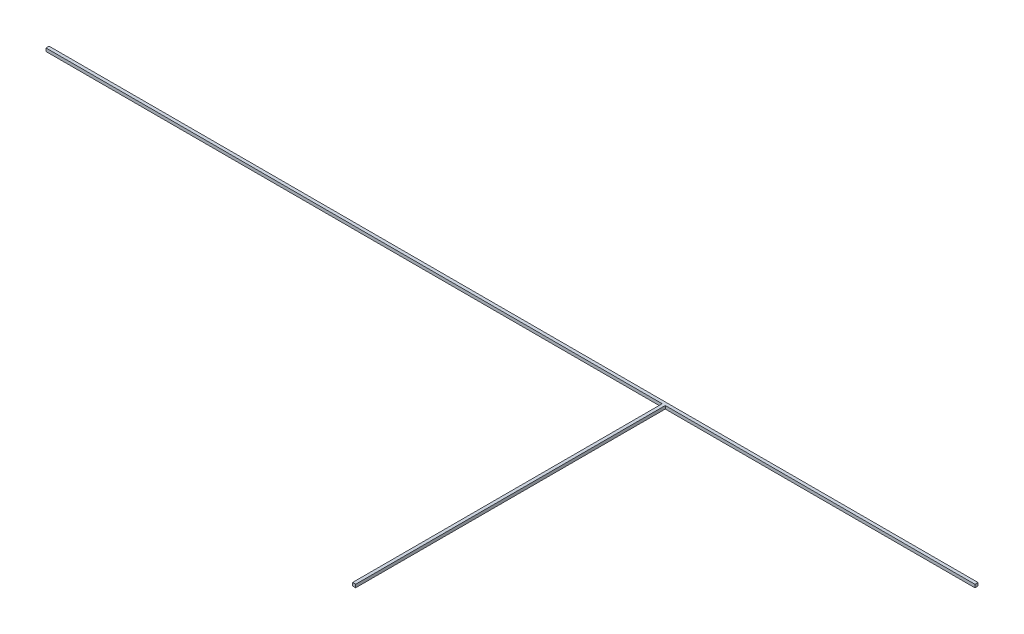
ISO-10303-21;
HEADER;
FILE_DESCRIPTION(('STEP AP214'),'2;1');
FILE_NAME('part.step','',(''),(''),'','','');
FILE_SCHEMA(('AUTOMOTIVE_DESIGN { 1 0 10303 214 1 1 1 1 }'));
ENDSEC;
DATA;
#1=APPLICATION_CONTEXT('core data for automotive mechanical design processes');
#2=APPLICATION_PROTOCOL_DEFINITION('international standard','automotive_design',2000,#1);
#3=PRODUCT_CONTEXT('',#1,'mechanical');
#4=PRODUCT('Part','Part','',(#3));
#5=PRODUCT_RELATED_PRODUCT_CATEGORY('part','',(#4));
#6=PRODUCT_DEFINITION_FORMATION('','',#4);
#7=PRODUCT_DEFINITION_CONTEXT('part definition',#1,'design');
#8=PRODUCT_DEFINITION('design','',#6,#7);
#9=PRODUCT_DEFINITION_SHAPE('','',#8);
#10=(LENGTH_UNIT() NAMED_UNIT(*) SI_UNIT(.MILLI.,.METRE.));
#11=(NAMED_UNIT(*) PLANE_ANGLE_UNIT() SI_UNIT($,.RADIAN.));
#12=(NAMED_UNIT(*) SI_UNIT($,.STERADIAN.) SOLID_ANGLE_UNIT());
#13=UNCERTAINTY_MEASURE_WITH_UNIT(LENGTH_MEASURE(1.E-05),#10,'distance_accuracy_value','');
#14=(GEOMETRIC_REPRESENTATION_CONTEXT(3) GLOBAL_UNCERTAINTY_ASSIGNED_CONTEXT((#13)) GLOBAL_UNIT_ASSIGNED_CONTEXT((#10,
#11,#12)) REPRESENTATION_CONTEXT('',''));
#15=CARTESIAN_POINT('',(0.,0.,0.));
#16=DIRECTION('',(0.,0.,1.));
#17=DIRECTION('',(1.,0.,0.));
#18=AXIS2_PLACEMENT_3D('',#15,#16,#17);
#19=CARTESIAN_POINT('',(300.,0.442028985507246,0.362318840579711));
#20=DIRECTION('',(0.,0.,-1.));
#21=DIRECTION('',(0.,1.,0.));
#22=AXIS2_PLACEMENT_3D('',#19,#20,#21);
#23=PLANE('',#22);
#24=DIRECTION('',(0.,-1.,0.));
#25=VECTOR('',#24,1.);
#26=CARTESIAN_POINT('',(199.,0.442028985507246,0.362318840579711));
#27=LINE('',#26,#25);
#28=CARTESIAN_POINT('',(199.,0.442028985507246,0.362318840579711));
#29=VERTEX_POINT('',#28);
#30=CARTESIAN_POINT('',(199.,-0.557971014492754,0.362318840579711));
#31=VERTEX_POINT('',#30);
#32=EDGE_CURVE('E50',#29,#31,#27,.T.);
#33=ORIENTED_EDGE('',*,*,#32,.F.);
#34=DIRECTION('',(-1.,0.,0.));
#35=VECTOR('',#34,1.);
#36=CARTESIAN_POINT('',(300.,0.442028985507246,0.362318840579711));
#37=LINE('',#36,#35);
#38=CARTESIAN_POINT('',(0.,0.442028985507246,0.362318840579711));
#39=VERTEX_POINT('',#38);
#40=EDGE_CURVE('E136',#29,#39,#37,.T.);
#41=ORIENTED_EDGE('',*,*,#40,.T.);
#42=DIRECTION('',(0.,-1.,0.));
#43=VECTOR('',#42,1.);
#44=CARTESIAN_POINT('',(0.,0.442028985507246,0.362318840579711));
#45=LINE('',#44,#43);
#46=CARTESIAN_POINT('',(0.,-0.557971014492754,0.362318840579711));
#47=VERTEX_POINT('',#46);
#48=EDGE_CURVE('E119',#39,#47,#45,.T.);
#49=ORIENTED_EDGE('',*,*,#48,.T.);
#50=DIRECTION('',(-1.,0.,0.));
#51=VECTOR('',#50,1.);
#52=CARTESIAN_POINT('',(300.,-0.557971014492754,0.362318840579711));
#53=LINE('',#52,#51);
#54=EDGE_CURVE('E43',#31,#47,#53,.T.);
#55=ORIENTED_EDGE('',*,*,#54,.F.);
#56=EDGE_LOOP('',(#33,#41,#49,#55));
#57=FACE_BOUND('',#56,.T.);
#58=ADVANCED_FACE('F36',(#57),#23,.F.);
#59=DIRECTION('',(0.,1.,0.));
#60=VECTOR('',#59,1.);
#61=CARTESIAN_POINT('',(200.,0.442028985507246,0.362318840579711));
#62=LINE('',#61,#60);
#63=CARTESIAN_POINT('',(200.,-0.557971014492754,0.362318840579711));
#64=VERTEX_POINT('',#63);
#65=CARTESIAN_POINT('',(200.,0.442028985507246,0.362318840579711));
#66=VERTEX_POINT('',#65);
#67=EDGE_CURVE('E116',#64,#66,#62,.T.);
#68=ORIENTED_EDGE('',*,*,#67,.F.);
#69=CARTESIAN_POINT('',(300.,-0.557971014492754,0.362318840579711));
#70=VERTEX_POINT('',#69);
#71=EDGE_CURVE('E11',#70,#64,#53,.T.);
#72=ORIENTED_EDGE('',*,*,#71,.F.);
#73=DIRECTION('',(0.,-1.,0.));
#74=VECTOR('',#73,1.);
#75=CARTESIAN_POINT('',(300.,0.442028985507246,0.362318840579711));
#76=LINE('',#75,#74);
#77=CARTESIAN_POINT('',(300.,0.442028985507246,0.362318840579711));
#78=VERTEX_POINT('',#77);
#79=EDGE_CURVE('E127',#78,#70,#76,.T.);
#80=ORIENTED_EDGE('',*,*,#79,.F.);
#81=EDGE_CURVE('E143',#78,#66,#37,.T.);
#82=ORIENTED_EDGE('',*,*,#81,.T.);
#83=EDGE_LOOP('',(#68,#72,#80,#82));
#84=FACE_BOUND('',#83,.T.);
#85=ADVANCED_FACE('F180',(#84),#23,.F.);
#86=CARTESIAN_POINT('',(300.,-0.557971014492754,0.362318840579711));
#87=DIRECTION('',(0.,1.,0.));
#88=DIRECTION('',(0.,0.,1.));
#89=AXIS2_PLACEMENT_3D('',#86,#87,#88);
#90=PLANE('',#89);
#91=DIRECTION('',(0.,0.,-1.));
#92=VECTOR('',#91,1.);
#93=CARTESIAN_POINT('',(0.,-0.557971014492754,0.362318840579711));
#94=LINE('',#93,#92);
#95=CARTESIAN_POINT('',(0.,-0.557971014492754,-0.637681159420289));
#96=VERTEX_POINT('',#95);
#97=EDGE_CURVE('E121',#47,#96,#94,.T.);
#98=ORIENTED_EDGE('',*,*,#97,.T.);
#99=DIRECTION('',(-1.,0.,0.));
#100=VECTOR('',#99,1.);
#101=CARTESIAN_POINT('',(300.,-0.557971014492754,-0.637681159420289));
#102=LINE('',#101,#100);
#103=CARTESIAN_POINT('',(300.,-0.557971014492754,-0.637681159420289));
#104=VERTEX_POINT('',#103);
#105=EDGE_CURVE('E147',#104,#96,#102,.T.);
#106=ORIENTED_EDGE('',*,*,#105,.F.);
#107=DIRECTION('',(0.,0.,-1.));
#108=VECTOR('',#107,1.);
#109=CARTESIAN_POINT('',(300.,-0.557971014492754,0.362318840579711));
#110=LINE('',#109,#108);
#111=EDGE_CURVE('E130',#70,#104,#110,.T.);
#112=ORIENTED_EDGE('',*,*,#111,.F.);
#113=ORIENTED_EDGE('',*,*,#71,.T.);
#114=DIRECTION('',(0.,0.,-1.));
#115=VECTOR('',#114,1.);
#116=CARTESIAN_POINT('',(200.,-0.557971014492754,100.36231884058));
#117=LINE('',#116,#115);
#118=CARTESIAN_POINT('',(200.,-0.557971014492754,100.36231884058));
#119=VERTEX_POINT('',#118);
#120=EDGE_CURVE('E103',#119,#64,#117,.T.);
#121=ORIENTED_EDGE('',*,*,#120,.F.);
#122=DIRECTION('',(1.,0.,0.));
#123=VECTOR('',#122,1.);
#124=CARTESIAN_POINT('',(199.,-0.557971014492754,100.36231884058));
#125=LINE('',#124,#123);
#126=CARTESIAN_POINT('',(199.,-0.557971014492754,100.36231884058));
#127=VERTEX_POINT('',#126);
#128=EDGE_CURVE('E97',#127,#119,#125,.T.);
#129=ORIENTED_EDGE('',*,*,#128,.F.);
#130=DIRECTION('',(0.,0.,-1.));
#131=VECTOR('',#130,1.);
#132=CARTESIAN_POINT('',(199.,-0.557971014492754,100.36231884058));
#133=LINE('',#132,#131);
#134=EDGE_CURVE('E101',#127,#31,#133,.T.);
#135=ORIENTED_EDGE('',*,*,#134,.T.);
#136=ORIENTED_EDGE('',*,*,#54,.T.);
#137=EDGE_LOOP('',(#98,#106,#112,#113,#121,#129,#135,#136));
#138=FACE_BOUND('',#137,.T.);
#139=ADVANCED_FACE('F99',(#138),#90,.F.);
#140=CARTESIAN_POINT('',(300.,0.442028985507246,-0.637681159420289));
#141=DIRECTION('',(0.,0.,1.));
#142=DIRECTION('',(0.,-1.,0.));
#143=AXIS2_PLACEMENT_3D('',#140,#141,#142);
#144=PLANE('',#143);
#145=DIRECTION('',(0.,1.,0.));
#146=VECTOR('',#145,1.);
#147=CARTESIAN_POINT('',(0.,0.442028985507246,-0.637681159420289));
#148=LINE('',#147,#146);
#149=CARTESIAN_POINT('',(0.,0.442028985507246,-0.637681159420289));
#150=VERTEX_POINT('',#149);
#151=EDGE_CURVE('E139',#96,#150,#148,.T.);
#152=ORIENTED_EDGE('',*,*,#151,.T.);
#153=DIRECTION('',(-1.,0.,0.));
#154=VECTOR('',#153,1.);
#155=CARTESIAN_POINT('',(300.,0.442028985507246,-0.637681159420289));
#156=LINE('',#155,#154);
#157=CARTESIAN_POINT('',(300.,0.442028985507246,-0.637681159420289));
#158=VERTEX_POINT('',#157);
#159=EDGE_CURVE('E145',#158,#150,#156,.T.);
#160=ORIENTED_EDGE('',*,*,#159,.F.);
#161=DIRECTION('',(0.,1.,0.));
#162=VECTOR('',#161,1.);
#163=CARTESIAN_POINT('',(300.,0.442028985507246,-0.637681159420289));
#164=LINE('',#163,#162);
#165=EDGE_CURVE('E133',#104,#158,#164,.T.);
#166=ORIENTED_EDGE('',*,*,#165,.F.);
#167=ORIENTED_EDGE('',*,*,#105,.T.);
#168=EDGE_LOOP('',(#152,#160,#166,#167));
#169=FACE_BOUND('',#168,.T.);
#170=ADVANCED_FACE('F163',(#169),#144,.F.);
#171=CARTESIAN_POINT('',(300.,0.442028985507246,0.362318840579711));
#172=DIRECTION('',(0.,-1.,0.));
#173=DIRECTION('',(0.,0.,-1.));
#174=AXIS2_PLACEMENT_3D('',#171,#172,#173);
#175=PLANE('',#174);
#176=DIRECTION('',(0.,0.,1.));
#177=VECTOR('',#176,1.);
#178=CARTESIAN_POINT('',(0.,0.442028985507246,0.362318840579711));
#179=LINE('',#178,#177);
#180=EDGE_CURVE('E131',#150,#39,#179,.T.);
#181=ORIENTED_EDGE('',*,*,#180,.T.);
#182=ORIENTED_EDGE('',*,*,#40,.F.);
#183=DIRECTION('',(0.,0.,-1.));
#184=VECTOR('',#183,1.);
#185=CARTESIAN_POINT('',(199.,0.442028985507246,100.36231884058));
#186=LINE('',#185,#184);
#187=CARTESIAN_POINT('',(199.,0.442028985507246,100.36231884058));
#188=VERTEX_POINT('',#187);
#189=EDGE_CURVE('E175',#188,#29,#186,.T.);
#190=ORIENTED_EDGE('',*,*,#189,.F.);
#191=DIRECTION('',(-1.,0.,0.));
#192=VECTOR('',#191,1.);
#193=CARTESIAN_POINT('',(199.,0.442028985507246,100.36231884058));
#194=LINE('',#193,#192);
#195=CARTESIAN_POINT('',(200.,0.442028985507246,100.36231884058));
#196=VERTEX_POINT('',#195);
#197=EDGE_CURVE('E112',#196,#188,#194,.T.);
#198=ORIENTED_EDGE('',*,*,#197,.F.);
#199=DIRECTION('',(0.,0.,-1.));
#200=VECTOR('',#199,1.);
#201=CARTESIAN_POINT('',(200.,0.442028985507246,100.36231884058));
#202=LINE('',#201,#200);
#203=EDGE_CURVE('E123',#196,#66,#202,.T.);
#204=ORIENTED_EDGE('',*,*,#203,.T.);
#205=ORIENTED_EDGE('',*,*,#81,.F.);
#206=DIRECTION('',(0.,0.,1.));
#207=VECTOR('',#206,1.);
#208=CARTESIAN_POINT('',(300.,0.442028985507246,0.362318840579711));
#209=LINE('',#208,#207);
#210=EDGE_CURVE('E135',#158,#78,#209,.T.);
#211=ORIENTED_EDGE('',*,*,#210,.F.);
#212=ORIENTED_EDGE('',*,*,#159,.T.);
#213=EDGE_LOOP('',(#181,#182,#190,#198,#204,#205,#211,#212));
#214=FACE_BOUND('',#213,.T.);
#215=ADVANCED_FACE('F159',(#214),#175,.F.);
#216=CARTESIAN_POINT('',(300.,0.,0.));
#217=DIRECTION('',(1.,0.,0.));
#218=DIRECTION('',(0.,0.,-1.));
#219=AXIS2_PLACEMENT_3D('',#216,#217,#218);
#220=PLANE('',#219);
#221=ORIENTED_EDGE('',*,*,#79,.T.);
#222=ORIENTED_EDGE('',*,*,#111,.T.);
#223=ORIENTED_EDGE('',*,*,#165,.T.);
#224=ORIENTED_EDGE('',*,*,#210,.T.);
#225=EDGE_LOOP('',(#221,#222,#223,#224));
#226=FACE_BOUND('',#225,.T.);
#227=ADVANCED_FACE('F165',(#226),#220,.T.);
#228=CARTESIAN_POINT('',(0.,0.,0.));
#229=DIRECTION('',(1.,0.,0.));
#230=DIRECTION('',(0.,0.,-1.));
#231=AXIS2_PLACEMENT_3D('',#228,#229,#230);
#232=PLANE('',#231);
#233=ORIENTED_EDGE('',*,*,#48,.F.);
#234=ORIENTED_EDGE('',*,*,#180,.F.);
#235=ORIENTED_EDGE('',*,*,#151,.F.);
#236=ORIENTED_EDGE('',*,*,#97,.F.);
#237=EDGE_LOOP('',(#233,#234,#235,#236));
#238=FACE_BOUND('',#237,.T.);
#239=ADVANCED_FACE('F156',(#238),#232,.F.);
#240=CARTESIAN_POINT('',(199.,0.442028985507246,100.36231884058));
#241=DIRECTION('',(1.,0.,0.));
#242=DIRECTION('',(0.,0.,-1.));
#243=AXIS2_PLACEMENT_3D('',#240,#241,#242);
#244=PLANE('',#243);
#245=ORIENTED_EDGE('',*,*,#32,.T.);
#246=ORIENTED_EDGE('',*,*,#134,.F.);
#247=DIRECTION('',(0.,-1.,0.));
#248=VECTOR('',#247,1.);
#249=CARTESIAN_POINT('',(199.,0.442028985507246,100.36231884058));
#250=LINE('',#249,#248);
#251=EDGE_CURVE('E107',#188,#127,#250,.T.);
#252=ORIENTED_EDGE('',*,*,#251,.F.);
#253=ORIENTED_EDGE('',*,*,#189,.T.);
#254=EDGE_LOOP('',(#245,#246,#252,#253));
#255=FACE_BOUND('',#254,.T.);
#256=ADVANCED_FACE('F118',(#255),#244,.F.);
#257=CARTESIAN_POINT('',(200.,0.442028985507246,100.36231884058));
#258=DIRECTION('',(-1.,0.,0.));
#259=DIRECTION('',(0.,0.,1.));
#260=AXIS2_PLACEMENT_3D('',#257,#258,#259);
#261=PLANE('',#260);
#262=ORIENTED_EDGE('',*,*,#67,.T.);
#263=ORIENTED_EDGE('',*,*,#203,.F.);
#264=DIRECTION('',(0.,1.,0.));
#265=VECTOR('',#264,1.);
#266=CARTESIAN_POINT('',(200.,0.442028985507246,100.36231884058));
#267=LINE('',#266,#265);
#268=EDGE_CURVE('E106',#119,#196,#267,.T.);
#269=ORIENTED_EDGE('',*,*,#268,.F.);
#270=ORIENTED_EDGE('',*,*,#120,.T.);
#271=EDGE_LOOP('',(#262,#263,#269,#270));
#272=FACE_BOUND('',#271,.T.);
#273=ADVANCED_FACE('F171',(#272),#261,.F.);
#274=CARTESIAN_POINT('',(0.,0.,100.36231884058));
#275=DIRECTION('',(0.,0.,1.));
#276=DIRECTION('',(1.,0.,0.));
#277=AXIS2_PLACEMENT_3D('',#274,#275,#276);
#278=PLANE('',#277);
#279=ORIENTED_EDGE('',*,*,#251,.T.);
#280=ORIENTED_EDGE('',*,*,#128,.T.);
#281=ORIENTED_EDGE('',*,*,#268,.T.);
#282=ORIENTED_EDGE('',*,*,#197,.T.);
#283=EDGE_LOOP('',(#279,#280,#281,#282));
#284=FACE_BOUND('',#283,.T.);
#285=ADVANCED_FACE('F110',(#284),#278,.T.);
#286=CLOSED_SHELL('',(#58,#85,#139,#170,#215,#227,#239,#256,#273,#285));
#287=MANIFOLD_SOLID_BREP('B2',#286);
#288=ADVANCED_BREP_SHAPE_REPRESENTATION('',(#18,#287),#14);
#289=SHAPE_DEFINITION_REPRESENTATION(#9,#288);
ENDSEC;
END-ISO-10303-21;
